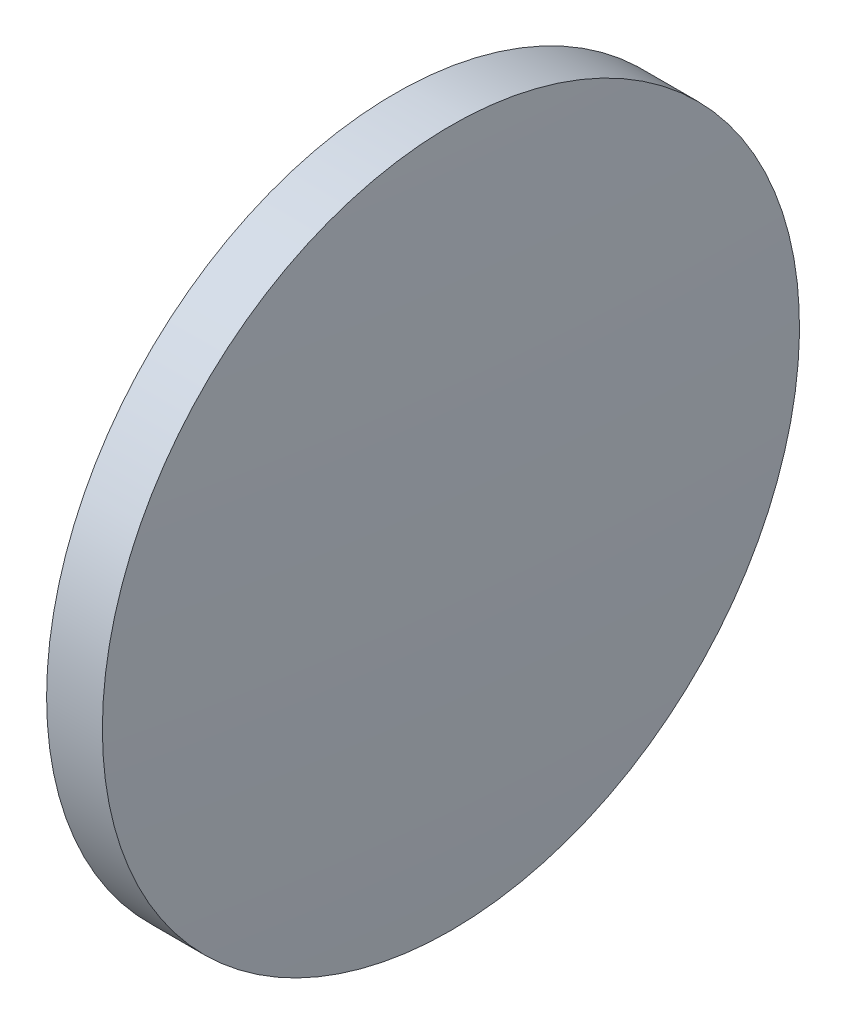
ISO-10303-21;
HEADER;
FILE_DESCRIPTION(('STEP AP214'),'2;1');
FILE_NAME('part.step','',(''),(''),'','','');
FILE_SCHEMA(('AUTOMOTIVE_DESIGN { 1 0 10303 214 1 1 1 1 }'));
ENDSEC;
DATA;
#1=APPLICATION_CONTEXT('core data for automotive mechanical design processes');
#2=APPLICATION_PROTOCOL_DEFINITION('international standard','automotive_design',2000,#1);
#3=PRODUCT_CONTEXT('',#1,'mechanical');
#4=PRODUCT('Part','Part','',(#3));
#5=PRODUCT_RELATED_PRODUCT_CATEGORY('part','',(#4));
#6=PRODUCT_DEFINITION_FORMATION('','',#4);
#7=PRODUCT_DEFINITION_CONTEXT('part definition',#1,'design');
#8=PRODUCT_DEFINITION('design','',#6,#7);
#9=PRODUCT_DEFINITION_SHAPE('','',#8);
#10=(LENGTH_UNIT() NAMED_UNIT(*) SI_UNIT(.MILLI.,.METRE.));
#11=(NAMED_UNIT(*) PLANE_ANGLE_UNIT() SI_UNIT($,.RADIAN.));
#12=(NAMED_UNIT(*) SI_UNIT($,.STERADIAN.) SOLID_ANGLE_UNIT());
#13=UNCERTAINTY_MEASURE_WITH_UNIT(LENGTH_MEASURE(1.E-05),#10,'distance_accuracy_value','');
#14=(GEOMETRIC_REPRESENTATION_CONTEXT(3) GLOBAL_UNCERTAINTY_ASSIGNED_CONTEXT((#13)) GLOBAL_UNIT_ASSIGNED_CONTEXT((#10,
#11,#12)) REPRESENTATION_CONTEXT('',''));
#15=CARTESIAN_POINT('',(0.,0.,0.));
#16=DIRECTION('',(0.,0.,1.));
#17=DIRECTION('',(1.,0.,0.));
#18=AXIS2_PLACEMENT_3D('',#15,#16,#17);
#19=CARTESIAN_POINT('',(333.507650043666,81.3731873297557,0.));
#20=DIRECTION('',(-1.,0.,0.));
#21=DIRECTION('',(0.,-1.,0.));
#22=AXIS2_PLACEMENT_3D('',#19,#20,#21);
#23=SPHERICAL_SURFACE('',#22,260.566666666664);
#24=CARTESIAN_POINT('',(593.774316710331,81.3731873297551,0.));
#25=DIRECTION('',(-1.,0.,0.));
#26=DIRECTION('',(0.,0.,1.));
#27=AXIS2_PLACEMENT_3D('',#24,#25,#26);
#28=CIRCLE('',#27,12.5);
#29=CARTESIAN_POINT('',(593.774316710331,81.3731873297551,12.5));
#30=VERTEX_POINT('',#29);
#31=EDGE_CURVE('E10',#30,#30,#28,.T.);
#32=ORIENTED_EDGE('',*,*,#31,.F.);
#33=EDGE_LOOP('',(#32));
#34=FACE_BOUND('',#33,.T.);
#35=ADVANCED_FACE('F33',(#34),#23,.T.);
#36=CARTESIAN_POINT('',(589.40870080757,81.3731873297551,0.));
#37=DIRECTION('',(-1.,0.,0.));
#38=DIRECTION('',(0.,0.,1.));
#39=AXIS2_PLACEMENT_3D('',#36,#37,#38);
#40=CYLINDRICAL_SURFACE('',#39,12.5);
#41=CARTESIAN_POINT('',(591.774316710331,81.3731873297551,0.));
#42=DIRECTION('',(-1.,0.,0.));
#43=DIRECTION('',(0.,0.,1.));
#44=AXIS2_PLACEMENT_3D('',#41,#42,#43);
#45=CIRCLE('',#44,12.5);
#46=CARTESIAN_POINT('',(591.774316710331,81.3731873297551,12.5));
#47=VERTEX_POINT('',#46);
#48=EDGE_CURVE('E39',#47,#47,#45,.T.);
#49=ORIENTED_EDGE('',*,*,#48,.F.);
#50=EDGE_LOOP('',(#49));
#51=FACE_BOUND('',#50,.T.);
#52=ORIENTED_EDGE('',*,*,#31,.T.);
#53=EDGE_LOOP('',(#52));
#54=FACE_BOUND('',#53,.T.);
#55=ADVANCED_FACE('F47',(#51,#54),#40,.T.);
#56=CARTESIAN_POINT('',(591.774316710331,81.3731873297551,0.));
#57=DIRECTION('',(1.,0.,0.));
#58=DIRECTION('',(0.,0.,-1.));
#59=AXIS2_PLACEMENT_3D('',#56,#57,#58);
#60=PLANE('',#59);
#61=ORIENTED_EDGE('',*,*,#48,.T.);
#62=EDGE_LOOP('',(#61));
#63=FACE_BOUND('',#62,.T.);
#64=ADVANCED_FACE('F45',(#63),#60,.F.);
#65=CLOSED_SHELL('',(#35,#55,#64));
#66=MANIFOLD_SOLID_BREP('B2',#65);
#67=ADVANCED_BREP_SHAPE_REPRESENTATION('',(#18,#66),#14);
#68=SHAPE_DEFINITION_REPRESENTATION(#9,#67);
ENDSEC;
END-ISO-10303-21;
